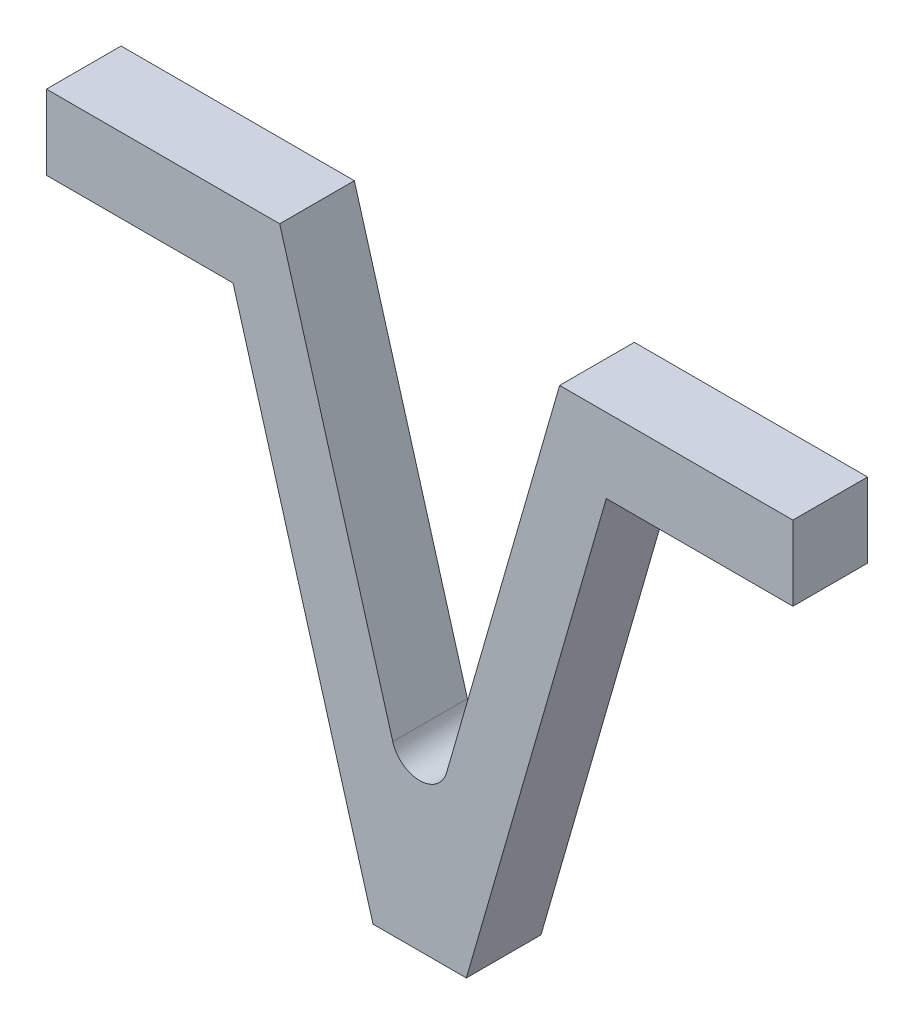
ISO-10303-21;
HEADER;
FILE_DESCRIPTION(('STEP AP214'),'2;1');
FILE_NAME('part.step','',(''),(''),'','','');
FILE_SCHEMA(('AUTOMOTIVE_DESIGN { 1 0 10303 214 1 1 1 1 }'));
ENDSEC;
DATA;
#1=APPLICATION_CONTEXT('core data for automotive mechanical design processes');
#2=APPLICATION_PROTOCOL_DEFINITION('international standard','automotive_design',2000,#1);
#3=PRODUCT_CONTEXT('',#1,'mechanical');
#4=PRODUCT('Part','Part','',(#3));
#5=PRODUCT_RELATED_PRODUCT_CATEGORY('part','',(#4));
#6=PRODUCT_DEFINITION_FORMATION('','',#4);
#7=PRODUCT_DEFINITION_CONTEXT('part definition',#1,'design');
#8=PRODUCT_DEFINITION('design','',#6,#7);
#9=PRODUCT_DEFINITION_SHAPE('','',#8);
#10=(LENGTH_UNIT() NAMED_UNIT(*) SI_UNIT(.MILLI.,.METRE.));
#11=(NAMED_UNIT(*) PLANE_ANGLE_UNIT() SI_UNIT($,.RADIAN.));
#12=(NAMED_UNIT(*) SI_UNIT($,.STERADIAN.) SOLID_ANGLE_UNIT());
#13=UNCERTAINTY_MEASURE_WITH_UNIT(LENGTH_MEASURE(1.E-05),#10,'distance_accuracy_value','');
#14=(GEOMETRIC_REPRESENTATION_CONTEXT(3) GLOBAL_UNCERTAINTY_ASSIGNED_CONTEXT((#13)) GLOBAL_UNIT_ASSIGNED_CONTEXT((#10,
#11,#12)) REPRESENTATION_CONTEXT('',''));
#15=CARTESIAN_POINT('',(0.,0.,0.));
#16=DIRECTION('',(0.,0.,1.));
#17=DIRECTION('',(1.,0.,0.));
#18=AXIS2_PLACEMENT_3D('',#15,#16,#17);
#19=CARTESIAN_POINT('',(-40.8614423734127,40.7635331867326,8.));
#20=DIRECTION('',(1.,0.,0.));
#21=DIRECTION('',(0.,0.,-1.));
#22=AXIS2_PLACEMENT_3D('',#19,#20,#21);
#23=PLANE('',#22);
#24=DIRECTION('',(0.,-1.,0.));
#25=VECTOR('',#24,1.);
#26=CARTESIAN_POINT('',(-40.8614423734127,40.7635331867326,0.));
#27=LINE('',#26,#25);
#28=CARTESIAN_POINT('',(-40.8614423734127,48.7635331867326,0.));
#29=VERTEX_POINT('',#28);
#30=CARTESIAN_POINT('',(-40.8614423734127,40.7635331867326,0.));
#31=VERTEX_POINT('',#30);
#32=EDGE_CURVE('E145',#29,#31,#27,.T.);
#33=ORIENTED_EDGE('',*,*,#32,.T.);
#34=DIRECTION('',(0.,0.,-1.));
#35=VECTOR('',#34,1.);
#36=CARTESIAN_POINT('',(-40.8614423734127,40.7635331867326,8.));
#37=LINE('',#36,#35);
#38=CARTESIAN_POINT('',(-40.8614423734127,40.7635331867326,8.));
#39=VERTEX_POINT('',#38);
#40=EDGE_CURVE('E126',#39,#31,#37,.T.);
#41=ORIENTED_EDGE('',*,*,#40,.F.);
#42=DIRECTION('',(0.,-1.,0.));
#43=VECTOR('',#42,1.);
#44=CARTESIAN_POINT('',(-40.8614423734127,40.7635331867326,8.));
#45=LINE('',#44,#43);
#46=CARTESIAN_POINT('',(-40.8614423734127,48.7635331867326,8.));
#47=VERTEX_POINT('',#46);
#48=EDGE_CURVE('E133',#47,#39,#45,.T.);
#49=ORIENTED_EDGE('',*,*,#48,.F.);
#50=DIRECTION('',(0.,0.,-1.));
#51=VECTOR('',#50,1.);
#52=CARTESIAN_POINT('',(-40.8614423734127,48.7635331867326,8.));
#53=LINE('',#52,#51);
#54=EDGE_CURVE('E174',#47,#29,#53,.T.);
#55=ORIENTED_EDGE('',*,*,#54,.T.);
#56=EDGE_LOOP('',(#33,#41,#49,#55));
#57=FACE_BOUND('',#56,.T.);
#58=ADVANCED_FACE('F33',(#57),#23,.F.);
#59=CARTESIAN_POINT('',(-20.8614423734127,40.7635331867326,8.));
#60=DIRECTION('',(0.,1.,0.));
#61=DIRECTION('',(0.,0.,1.));
#62=AXIS2_PLACEMENT_3D('',#59,#60,#61);
#63=PLANE('',#62);
#64=DIRECTION('',(1.,0.,0.));
#65=VECTOR('',#64,1.);
#66=CARTESIAN_POINT('',(-20.8614423734127,40.7635331867326,0.));
#67=LINE('',#66,#65);
#68=CARTESIAN_POINT('',(-20.8614423734127,40.7635331867326,0.));
#69=VERTEX_POINT('',#68);
#70=EDGE_CURVE('E193',#31,#69,#67,.T.);
#71=ORIENTED_EDGE('',*,*,#70,.T.);
#72=DIRECTION('',(0.,0.,-1.));
#73=VECTOR('',#72,1.);
#74=CARTESIAN_POINT('',(-20.8614423734127,40.7635331867326,8.));
#75=LINE('',#74,#73);
#76=CARTESIAN_POINT('',(-20.8614423734127,40.7635331867326,8.));
#77=VERTEX_POINT('',#76);
#78=EDGE_CURVE('E129',#77,#69,#75,.T.);
#79=ORIENTED_EDGE('',*,*,#78,.F.);
#80=DIRECTION('',(1.,0.,0.));
#81=VECTOR('',#80,1.);
#82=CARTESIAN_POINT('',(-20.8614423734127,40.7635331867326,8.));
#83=LINE('',#82,#81);
#84=EDGE_CURVE('E122',#39,#77,#83,.T.);
#85=ORIENTED_EDGE('',*,*,#84,.F.);
#86=ORIENTED_EDGE('',*,*,#40,.T.);
#87=EDGE_LOOP('',(#71,#79,#85,#86));
#88=FACE_BOUND('',#87,.T.);
#89=ADVANCED_FACE('F124',(#88),#63,.F.);
#90=CARTESIAN_POINT('',(-5.8614423734127,-11.2364668132674,8.));
#91=DIRECTION('',(0.960823591180895,0.277160651302181,0.));
#92=DIRECTION('',(-0.277160651302181,0.960823591180895,0.));
#93=AXIS2_PLACEMENT_3D('',#90,#91,#92);
#94=PLANE('',#93);
#95=DIRECTION('',(0.277160651302181,-0.960823591180895,0.));
#96=VECTOR('',#95,1.);
#97=CARTESIAN_POINT('',(-5.8614423734127,-11.2364668132674,0.));
#98=LINE('',#97,#96);
#99=CARTESIAN_POINT('',(-5.8614423734127,-11.2364668132674,0.));
#100=VERTEX_POINT('',#99);
#101=EDGE_CURVE('E191',#69,#100,#98,.T.);
#102=ORIENTED_EDGE('',*,*,#101,.T.);
#103=DIRECTION('',(0.,0.,-1.));
#104=VECTOR('',#103,1.);
#105=CARTESIAN_POINT('',(-5.8614423734127,-11.2364668132674,8.));
#106=LINE('',#105,#104);
#107=CARTESIAN_POINT('',(-5.8614423734127,-11.2364668132674,8.));
#108=VERTEX_POINT('',#107);
#109=EDGE_CURVE('E150',#108,#100,#106,.T.);
#110=ORIENTED_EDGE('',*,*,#109,.F.);
#111=DIRECTION('',(0.277160651302181,-0.960823591180895,0.));
#112=VECTOR('',#111,1.);
#113=CARTESIAN_POINT('',(-5.8614423734127,-11.2364668132674,8.));
#114=LINE('',#113,#112);
#115=EDGE_CURVE('E132',#77,#108,#114,.T.);
#116=ORIENTED_EDGE('',*,*,#115,.F.);
#117=ORIENTED_EDGE('',*,*,#78,.T.);
#118=EDGE_LOOP('',(#102,#110,#116,#117));
#119=FACE_BOUND('',#118,.T.);
#120=ADVANCED_FACE('F215',(#119),#94,.F.);
#121=CARTESIAN_POINT('',(4.1385576265873,-11.2364668132674,8.));
#122=DIRECTION('',(0.,1.,0.));
#123=DIRECTION('',(-1.,0.,0.));
#124=AXIS2_PLACEMENT_3D('',#121,#122,#123);
#125=PLANE('',#124);
#126=DIRECTION('',(1.,0.,0.));
#127=VECTOR('',#126,1.);
#128=CARTESIAN_POINT('',(4.1385576265873,-11.2364668132674,0.));
#129=LINE('',#128,#127);
#130=CARTESIAN_POINT('',(4.1385576265873,-11.2364668132674,0.));
#131=VERTEX_POINT('',#130);
#132=EDGE_CURVE('E189',#100,#131,#129,.T.);
#133=ORIENTED_EDGE('',*,*,#132,.T.);
#134=DIRECTION('',(0.,0.,-1.));
#135=VECTOR('',#134,1.);
#136=CARTESIAN_POINT('',(4.1385576265873,-11.2364668132674,8.));
#137=LINE('',#136,#135);
#138=CARTESIAN_POINT('',(4.1385576265873,-11.2364668132674,8.));
#139=VERTEX_POINT('',#138);
#140=EDGE_CURVE('E156',#139,#131,#137,.T.);
#141=ORIENTED_EDGE('',*,*,#140,.F.);
#142=DIRECTION('',(1.,0.,0.));
#143=VECTOR('',#142,1.);
#144=CARTESIAN_POINT('',(4.1385576265873,-11.2364668132674,8.));
#145=LINE('',#144,#143);
#146=EDGE_CURVE('E209',#108,#139,#145,.T.);
#147=ORIENTED_EDGE('',*,*,#146,.F.);
#148=ORIENTED_EDGE('',*,*,#109,.T.);
#149=EDGE_LOOP('',(#133,#141,#147,#148));
#150=FACE_BOUND('',#149,.T.);
#151=ADVANCED_FACE('F219',(#150),#125,.F.);
#152=CARTESIAN_POINT('',(4.1385576265873,-11.2364668132674,8.));
#153=DIRECTION('',(-0.960823591180895,0.277160651302181,0.));
#154=DIRECTION('',(-0.277160651302181,-0.960823591180895,0.));
#155=AXIS2_PLACEMENT_3D('',#152,#153,#154);
#156=PLANE('',#155);
#157=DIRECTION('',(0.277160651302181,0.960823591180895,0.));
#158=VECTOR('',#157,1.);
#159=CARTESIAN_POINT('',(4.1385576265873,-11.2364668132674,0.));
#160=LINE('',#159,#158);
#161=CARTESIAN_POINT('',(19.1385576265873,40.7635331867326,0.));
#162=VERTEX_POINT('',#161);
#163=EDGE_CURVE('E187',#131,#162,#160,.T.);
#164=ORIENTED_EDGE('',*,*,#163,.T.);
#165=DIRECTION('',(0.,0.,-1.));
#166=VECTOR('',#165,1.);
#167=CARTESIAN_POINT('',(19.1385576265873,40.7635331867326,8.));
#168=LINE('',#167,#166);
#169=CARTESIAN_POINT('',(19.1385576265873,40.7635331867326,8.));
#170=VERTEX_POINT('',#169);
#171=EDGE_CURVE('E159',#170,#162,#168,.T.);
#172=ORIENTED_EDGE('',*,*,#171,.F.);
#173=DIRECTION('',(0.277160651302181,0.960823591180895,0.));
#174=VECTOR('',#173,1.);
#175=CARTESIAN_POINT('',(4.1385576265873,-11.2364668132674,8.));
#176=LINE('',#175,#174);
#177=EDGE_CURVE('E207',#139,#170,#176,.T.);
#178=ORIENTED_EDGE('',*,*,#177,.F.);
#179=ORIENTED_EDGE('',*,*,#140,.T.);
#180=EDGE_LOOP('',(#164,#172,#178,#179));
#181=FACE_BOUND('',#180,.T.);
#182=ADVANCED_FACE('F224',(#181),#156,.F.);
#183=CARTESIAN_POINT('',(19.1385576265873,40.7635331867326,8.));
#184=DIRECTION('',(0.,1.,0.));
#185=DIRECTION('',(0.,0.,1.));
#186=AXIS2_PLACEMENT_3D('',#183,#184,#185);
#187=PLANE('',#186);
#188=DIRECTION('',(1.,0.,0.));
#189=VECTOR('',#188,1.);
#190=CARTESIAN_POINT('',(19.1385576265873,40.7635331867326,0.));
#191=LINE('',#190,#189);
#192=CARTESIAN_POINT('',(39.1385576265873,40.7635331867326,0.));
#193=VERTEX_POINT('',#192);
#194=EDGE_CURVE('E185',#162,#193,#191,.T.);
#195=ORIENTED_EDGE('',*,*,#194,.T.);
#196=DIRECTION('',(0.,0.,-1.));
#197=VECTOR('',#196,1.);
#198=CARTESIAN_POINT('',(39.1385576265873,40.7635331867326,8.));
#199=LINE('',#198,#197);
#200=CARTESIAN_POINT('',(39.1385576265873,40.7635331867326,8.));
#201=VERTEX_POINT('',#200);
#202=EDGE_CURVE('E162',#201,#193,#199,.T.);
#203=ORIENTED_EDGE('',*,*,#202,.F.);
#204=DIRECTION('',(1.,0.,0.));
#205=VECTOR('',#204,1.);
#206=CARTESIAN_POINT('',(19.1385576265873,40.7635331867326,8.));
#207=LINE('',#206,#205);
#208=EDGE_CURVE('E205',#170,#201,#207,.T.);
#209=ORIENTED_EDGE('',*,*,#208,.F.);
#210=ORIENTED_EDGE('',*,*,#171,.T.);
#211=EDGE_LOOP('',(#195,#203,#209,#210));
#212=FACE_BOUND('',#211,.T.);
#213=ADVANCED_FACE('F230',(#212),#187,.F.);
#214=CARTESIAN_POINT('',(39.1385576265873,40.7635331867326,8.));
#215=DIRECTION('',(-1.,0.,0.));
#216=DIRECTION('',(0.,0.,1.));
#217=AXIS2_PLACEMENT_3D('',#214,#215,#216);
#218=PLANE('',#217);
#219=DIRECTION('',(0.,1.,0.));
#220=VECTOR('',#219,1.);
#221=CARTESIAN_POINT('',(39.1385576265873,40.7635331867326,0.));
#222=LINE('',#221,#220);
#223=CARTESIAN_POINT('',(39.1385576265873,48.7635331867326,0.));
#224=VERTEX_POINT('',#223);
#225=EDGE_CURVE('E183',#193,#224,#222,.T.);
#226=ORIENTED_EDGE('',*,*,#225,.T.);
#227=DIRECTION('',(0.,0.,-1.));
#228=VECTOR('',#227,1.);
#229=CARTESIAN_POINT('',(39.1385576265873,48.7635331867326,8.));
#230=LINE('',#229,#228);
#231=CARTESIAN_POINT('',(39.1385576265873,48.7635331867326,8.));
#232=VERTEX_POINT('',#231);
#233=EDGE_CURVE('E165',#232,#224,#230,.T.);
#234=ORIENTED_EDGE('',*,*,#233,.F.);
#235=DIRECTION('',(0.,1.,0.));
#236=VECTOR('',#235,1.);
#237=CARTESIAN_POINT('',(39.1385576265873,40.7635331867326,8.));
#238=LINE('',#237,#236);
#239=EDGE_CURVE('E203',#201,#232,#238,.T.);
#240=ORIENTED_EDGE('',*,*,#239,.F.);
#241=ORIENTED_EDGE('',*,*,#202,.T.);
#242=EDGE_LOOP('',(#226,#234,#240,#241));
#243=FACE_BOUND('',#242,.T.);
#244=ADVANCED_FACE('F234',(#243),#218,.F.);
#245=CARTESIAN_POINT('',(39.1385576265873,48.7635331867326,8.));
#246=DIRECTION('',(0.,-1.,0.));
#247=DIRECTION('',(0.,0.,-1.));
#248=AXIS2_PLACEMENT_3D('',#245,#246,#247);
#249=PLANE('',#248);
#250=DIRECTION('',(-1.,0.,0.));
#251=VECTOR('',#250,1.);
#252=CARTESIAN_POINT('',(39.1385576265873,48.7635331867326,0.));
#253=LINE('',#252,#251);
#254=CARTESIAN_POINT('',(14.1385576265873,48.7635331867326,0.));
#255=VERTEX_POINT('',#254);
#256=EDGE_CURVE('E181',#224,#255,#253,.T.);
#257=ORIENTED_EDGE('',*,*,#256,.T.);
#258=DIRECTION('',(0.,0.,-1.));
#259=VECTOR('',#258,1.);
#260=CARTESIAN_POINT('',(14.1385576265873,48.7635331867326,8.));
#261=LINE('',#260,#259);
#262=CARTESIAN_POINT('',(14.1385576265873,48.7635331867326,8.));
#263=VERTEX_POINT('',#262);
#264=EDGE_CURVE('E168',#263,#255,#261,.T.);
#265=ORIENTED_EDGE('',*,*,#264,.F.);
#266=DIRECTION('',(-1.,0.,0.));
#267=VECTOR('',#266,1.);
#268=CARTESIAN_POINT('',(39.1385576265873,48.7635331867326,8.));
#269=LINE('',#268,#267);
#270=EDGE_CURVE('E201',#232,#263,#269,.T.);
#271=ORIENTED_EDGE('',*,*,#270,.F.);
#272=ORIENTED_EDGE('',*,*,#233,.T.);
#273=EDGE_LOOP('',(#257,#265,#271,#272));
#274=FACE_BOUND('',#273,.T.);
#275=ADVANCED_FACE('F239',(#274),#249,.F.);
#276=CARTESIAN_POINT('',(14.1385576265873,48.7635331867326,8.));
#277=DIRECTION('',(0.960823591180894,-0.277160651302181,0.));
#278=DIRECTION('',(0.277160651302181,0.960823591180895,0.));
#279=AXIS2_PLACEMENT_3D('',#276,#277,#278);
#280=PLANE('',#279);
#281=DIRECTION('',(-0.277160651302181,-0.960823591180894,0.));
#282=VECTOR('',#281,1.);
#283=CARTESIAN_POINT('',(14.1385576265873,48.7635331867326,0.));
#284=LINE('',#283,#282);
#285=CARTESIAN_POINT('',(2.02102840012999,6.75609853501395,0.));
#286=VERTEX_POINT('',#285);
#287=EDGE_CURVE('E179',#255,#286,#284,.T.);
#288=ORIENTED_EDGE('',*,*,#287,.T.);
#289=DIRECTION('',(0.,0.,-1.));
#290=VECTOR('',#289,1.);
#291=CARTESIAN_POINT('',(2.02102840012999,6.75609853501395,8.));
#292=LINE('',#291,#290);
#293=CARTESIAN_POINT('',(2.02102840012999,6.75609853501395,8.));
#294=VERTEX_POINT('',#293);
#295=EDGE_CURVE('E48',#286,#294,#292,.F.);
#296=ORIENTED_EDGE('',*,*,#295,.T.);
#297=DIRECTION('',(-0.277160651302181,-0.960823591180894,0.));
#298=VECTOR('',#297,1.);
#299=CARTESIAN_POINT('',(14.1385576265873,48.7635331867326,8.));
#300=LINE('',#299,#298);
#301=EDGE_CURVE('E199',#263,#294,#300,.T.);
#302=ORIENTED_EDGE('',*,*,#301,.F.);
#303=ORIENTED_EDGE('',*,*,#264,.T.);
#304=EDGE_LOOP('',(#288,#296,#302,#303));
#305=FACE_BOUND('',#304,.T.);
#306=ADVANCED_FACE('F258',(#305),#280,.F.);
#307=CARTESIAN_POINT('',(-15.8614423734127,48.7635331867326,8.));
#308=DIRECTION('',(-0.960823591180894,-0.277160651302181,0.));
#309=DIRECTION('',(0.277160651302181,-0.960823591180895,0.));
#310=AXIS2_PLACEMENT_3D('',#307,#308,#309);
#311=PLANE('',#310);
#312=DIRECTION('',(-0.277160651302181,0.960823591180894,0.));
#313=VECTOR('',#312,1.);
#314=CARTESIAN_POINT('',(-15.8614423734127,48.7635331867326,8.));
#315=LINE('',#314,#313);
#316=CARTESIAN_POINT('',(-3.74391314695539,6.75609853501395,8.));
#317=VERTEX_POINT('',#316);
#318=CARTESIAN_POINT('',(-15.8614423734127,48.7635331867326,8.));
#319=VERTEX_POINT('',#318);
#320=EDGE_CURVE('E197',#317,#319,#315,.T.);
#321=ORIENTED_EDGE('',*,*,#320,.F.);
#322=DIRECTION('',(0.,0.,-1.));
#323=VECTOR('',#322,1.);
#324=CARTESIAN_POINT('',(-3.74391314695538,6.75609853501395,0.));
#325=LINE('',#324,#323);
#326=CARTESIAN_POINT('',(-3.74391314695539,6.75609853501395,0.));
#327=VERTEX_POINT('',#326);
#328=EDGE_CURVE('E146',#317,#327,#325,.T.);
#329=ORIENTED_EDGE('',*,*,#328,.T.);
#330=DIRECTION('',(-0.277160651302181,0.960823591180894,0.));
#331=VECTOR('',#330,1.);
#332=CARTESIAN_POINT('',(-15.8614423734127,48.7635331867326,0.));
#333=LINE('',#332,#331);
#334=CARTESIAN_POINT('',(-15.8614423734127,48.7635331867326,0.));
#335=VERTEX_POINT('',#334);
#336=EDGE_CURVE('E177',#327,#335,#333,.T.);
#337=ORIENTED_EDGE('',*,*,#336,.T.);
#338=DIRECTION('',(0.,0.,-1.));
#339=VECTOR('',#338,1.);
#340=CARTESIAN_POINT('',(-15.8614423734127,48.7635331867326,8.));
#341=LINE('',#340,#339);
#342=EDGE_CURVE('E171',#319,#335,#341,.T.);
#343=ORIENTED_EDGE('',*,*,#342,.F.);
#344=EDGE_LOOP('',(#321,#329,#337,#343));
#345=FACE_BOUND('',#344,.T.);
#346=ADVANCED_FACE('F245',(#345),#311,.F.);
#347=CARTESIAN_POINT('',(-40.8614423734127,48.7635331867326,8.));
#348=DIRECTION('',(0.,-1.,0.));
#349=DIRECTION('',(0.,0.,-1.));
#350=AXIS2_PLACEMENT_3D('',#347,#348,#349);
#351=PLANE('',#350);
#352=DIRECTION('',(-1.,0.,0.));
#353=VECTOR('',#352,1.);
#354=CARTESIAN_POINT('',(-40.8614423734127,48.7635331867326,0.));
#355=LINE('',#354,#353);
#356=EDGE_CURVE('E142',#335,#29,#355,.T.);
#357=ORIENTED_EDGE('',*,*,#356,.T.);
#358=ORIENTED_EDGE('',*,*,#54,.F.);
#359=DIRECTION('',(-1.,0.,0.));
#360=VECTOR('',#359,1.);
#361=CARTESIAN_POINT('',(-40.8614423734127,48.7635331867326,8.));
#362=LINE('',#361,#360);
#363=EDGE_CURVE('E138',#319,#47,#362,.T.);
#364=ORIENTED_EDGE('',*,*,#363,.F.);
#365=ORIENTED_EDGE('',*,*,#342,.T.);
#366=EDGE_LOOP('',(#357,#358,#364,#365));
#367=FACE_BOUND('',#366,.T.);
#368=ADVANCED_FACE('F250',(#367),#351,.F.);
#369=CARTESIAN_POINT('',(0.,0.,8.));
#370=DIRECTION('',(0.,0.,-1.));
#371=DIRECTION('',(-1.,0.,0.));
#372=AXIS2_PLACEMENT_3D('',#369,#370,#371);
#373=PLANE('',#372);
#374=ORIENTED_EDGE('',*,*,#48,.T.);
#375=ORIENTED_EDGE('',*,*,#84,.T.);
#376=ORIENTED_EDGE('',*,*,#115,.T.);
#377=ORIENTED_EDGE('',*,*,#146,.T.);
#378=ORIENTED_EDGE('',*,*,#177,.T.);
#379=ORIENTED_EDGE('',*,*,#208,.T.);
#380=ORIENTED_EDGE('',*,*,#239,.T.);
#381=ORIENTED_EDGE('',*,*,#270,.T.);
#382=ORIENTED_EDGE('',*,*,#301,.T.);
#383=CARTESIAN_POINT('',(-0.861442373412701,7.58758048892049,8.));
#384=DIRECTION('',(0.,0.,-1.));
#385=DIRECTION('',(-1.,0.,0.));
#386=AXIS2_PLACEMENT_3D('',#383,#384,#385);
#387=CIRCLE('',#386,3.);
#388=EDGE_CURVE('E11',#294,#317,#387,.T.);
#389=ORIENTED_EDGE('',*,*,#388,.T.);
#390=ORIENTED_EDGE('',*,*,#320,.T.);
#391=ORIENTED_EDGE('',*,*,#363,.T.);
#392=EDGE_LOOP('',(#374,#375,#376,#377,#378,#379,#380,#381,#382,#389,#390,#391));
#393=FACE_BOUND('',#392,.T.);
#394=ADVANCED_FACE('F136',(#393),#373,.F.);
#395=CARTESIAN_POINT('',(0.,0.,0.));
#396=DIRECTION('',(0.,0.,-1.));
#397=DIRECTION('',(-1.,0.,0.));
#398=AXIS2_PLACEMENT_3D('',#395,#396,#397);
#399=PLANE('',#398);
#400=ORIENTED_EDGE('',*,*,#32,.F.);
#401=ORIENTED_EDGE('',*,*,#356,.F.);
#402=ORIENTED_EDGE('',*,*,#336,.F.);
#403=CARTESIAN_POINT('',(-0.861442373412701,7.58758048892049,0.));
#404=DIRECTION('',(0.,0.,-1.));
#405=DIRECTION('',(-1.,0.,0.));
#406=AXIS2_PLACEMENT_3D('',#403,#404,#405);
#407=CIRCLE('',#406,3.);
#408=EDGE_CURVE('E41',#327,#286,#407,.F.);
#409=ORIENTED_EDGE('',*,*,#408,.T.);
#410=ORIENTED_EDGE('',*,*,#287,.F.);
#411=ORIENTED_EDGE('',*,*,#256,.F.);
#412=ORIENTED_EDGE('',*,*,#225,.F.);
#413=ORIENTED_EDGE('',*,*,#194,.F.);
#414=ORIENTED_EDGE('',*,*,#163,.F.);
#415=ORIENTED_EDGE('',*,*,#132,.F.);
#416=ORIENTED_EDGE('',*,*,#101,.F.);
#417=ORIENTED_EDGE('',*,*,#70,.F.);
#418=EDGE_LOOP('',(#400,#401,#402,#409,#410,#411,#412,#413,#414,#415,#416,#417));
#419=FACE_BOUND('',#418,.T.);
#420=ADVANCED_FACE('F248',(#419),#399,.T.);
#421=CARTESIAN_POINT('',(-0.861442373412701,7.58758048892049,8.));
#422=DIRECTION('',(0.,0.,1.));
#423=DIRECTION('',(1.,0.,0.));
#424=AXIS2_PLACEMENT_3D('',#421,#422,#423);
#425=CYLINDRICAL_SURFACE('',#424,3.);
#426=ORIENTED_EDGE('',*,*,#388,.F.);
#427=ORIENTED_EDGE('',*,*,#295,.F.);
#428=ORIENTED_EDGE('',*,*,#408,.F.);
#429=ORIENTED_EDGE('',*,*,#328,.F.);
#430=EDGE_LOOP('',(#426,#427,#428,#429));
#431=FACE_BOUND('',#430,.T.);
#432=ADVANCED_FACE('F35',(#431),#425,.F.);
#433=CLOSED_SHELL('',(#58,#89,#120,#151,#182,#213,#244,#275,#306,#346,#368,#394,#420,#432));
#434=MANIFOLD_SOLID_BREP('B2',#433);
#435=ADVANCED_BREP_SHAPE_REPRESENTATION('',(#18,#434),#14);
#436=SHAPE_DEFINITION_REPRESENTATION(#9,#435);
ENDSEC;
END-ISO-10303-21;
